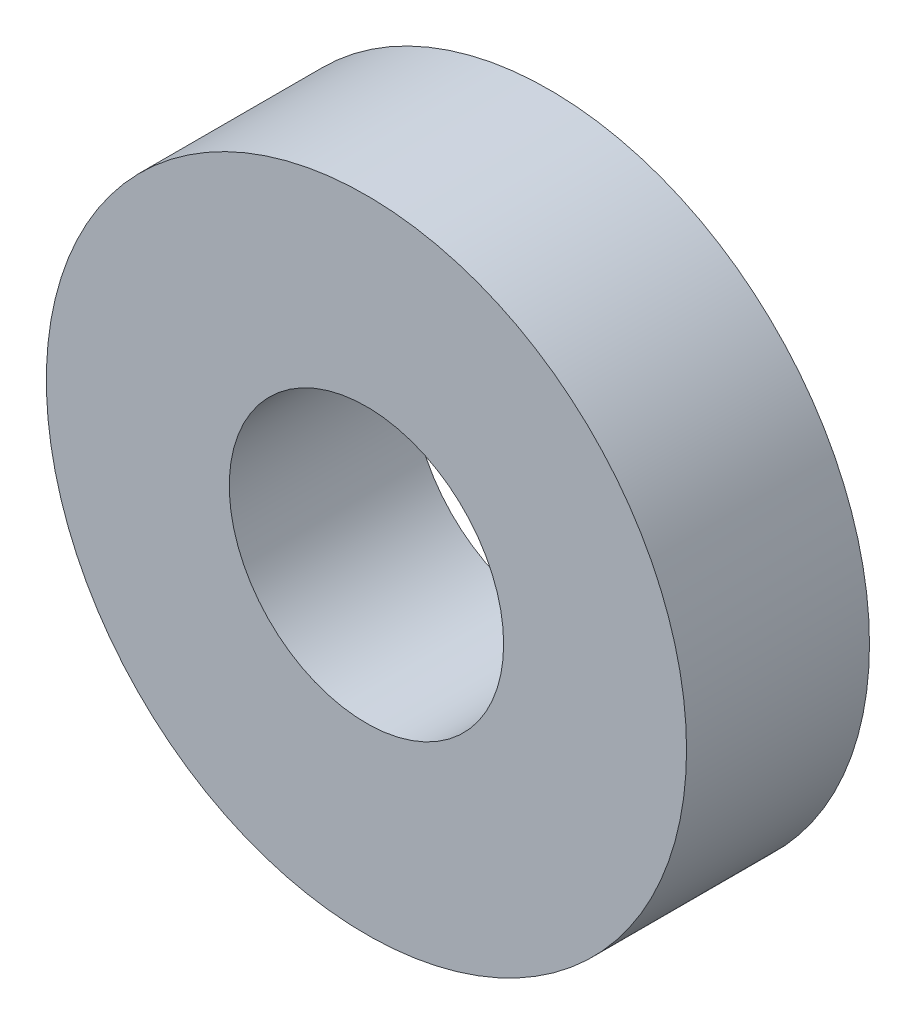
ISO-10303-21;
HEADER;
FILE_DESCRIPTION(('STEP AP214'),'2;1');
FILE_NAME('part.step','',(''),(''),'','','');
FILE_SCHEMA(('AUTOMOTIVE_DESIGN { 1 0 10303 214 1 1 1 1 }'));
ENDSEC;
DATA;
#1=APPLICATION_CONTEXT('core data for automotive mechanical design processes');
#2=APPLICATION_PROTOCOL_DEFINITION('international standard','automotive_design',2000,#1);
#3=PRODUCT_CONTEXT('',#1,'mechanical');
#4=PRODUCT('Part','Part','',(#3));
#5=PRODUCT_RELATED_PRODUCT_CATEGORY('part','',(#4));
#6=PRODUCT_DEFINITION_FORMATION('','',#4);
#7=PRODUCT_DEFINITION_CONTEXT('part definition',#1,'design');
#8=PRODUCT_DEFINITION('design','',#6,#7);
#9=PRODUCT_DEFINITION_SHAPE('','',#8);
#10=(LENGTH_UNIT() NAMED_UNIT(*) SI_UNIT(.MILLI.,.METRE.));
#11=(NAMED_UNIT(*) PLANE_ANGLE_UNIT() SI_UNIT($,.RADIAN.));
#12=(NAMED_UNIT(*) SI_UNIT($,.STERADIAN.) SOLID_ANGLE_UNIT());
#13=UNCERTAINTY_MEASURE_WITH_UNIT(LENGTH_MEASURE(1.E-05),#10,'distance_accuracy_value','');
#14=(GEOMETRIC_REPRESENTATION_CONTEXT(3) GLOBAL_UNCERTAINTY_ASSIGNED_CONTEXT((#13)) GLOBAL_UNIT_ASSIGNED_CONTEXT((#10,
#11,#12)) REPRESENTATION_CONTEXT('',''));
#15=CARTESIAN_POINT('',(0.,0.,0.));
#16=DIRECTION('',(0.,0.,1.));
#17=DIRECTION('',(1.,0.,0.));
#18=AXIS2_PLACEMENT_3D('',#15,#16,#17);
#19=CARTESIAN_POINT('',(0.,0.,1.));
#20=DIRECTION('',(0.,0.,1.));
#21=DIRECTION('',(1.,0.,0.));
#22=AXIS2_PLACEMENT_3D('',#19,#20,#21);
#23=PLANE('',#22);
#24=CARTESIAN_POINT('',(0.,0.,1.));
#25=DIRECTION('',(0.,0.,1.));
#26=DIRECTION('',(1.,0.,0.));
#27=AXIS2_PLACEMENT_3D('',#24,#25,#26);
#28=CIRCLE('',#27,1.75);
#29=CARTESIAN_POINT('',(1.75,0.,1.));
#30=VERTEX_POINT('',#29);
#31=EDGE_CURVE('E10',#30,#30,#28,.T.);
#32=ORIENTED_EDGE('',*,*,#31,.T.);
#33=EDGE_LOOP('',(#32));
#34=FACE_BOUND('',#33,.T.);
#35=CARTESIAN_POINT('',(0.,0.,1.));
#36=DIRECTION('',(0.,0.,1.));
#37=DIRECTION('',(1.,0.,0.));
#38=AXIS2_PLACEMENT_3D('',#35,#36,#37);
#39=CIRCLE('',#38,0.75);
#40=CARTESIAN_POINT('',(0.75,0.,1.));
#41=VERTEX_POINT('',#40);
#42=EDGE_CURVE('E41',#41,#41,#39,.T.);
#43=ORIENTED_EDGE('',*,*,#42,.F.);
#44=EDGE_LOOP('',(#43));
#45=FACE_BOUND('',#44,.T.);
#46=ADVANCED_FACE('F30',(#34,#45),#23,.T.);
#47=CARTESIAN_POINT('',(0.,0.,0.));
#48=DIRECTION('',(0.,0.,1.));
#49=DIRECTION('',(1.,0.,0.));
#50=AXIS2_PLACEMENT_3D('',#47,#48,#49);
#51=PLANE('',#50);
#52=CARTESIAN_POINT('',(0.,0.,0.));
#53=DIRECTION('',(0.,0.,1.));
#54=DIRECTION('',(1.,0.,0.));
#55=AXIS2_PLACEMENT_3D('',#52,#53,#54);
#56=CIRCLE('',#55,1.75);
#57=CARTESIAN_POINT('',(1.75,0.,0.));
#58=VERTEX_POINT('',#57);
#59=EDGE_CURVE('E34',#58,#58,#56,.T.);
#60=ORIENTED_EDGE('',*,*,#59,.F.);
#61=EDGE_LOOP('',(#60));
#62=FACE_BOUND('',#61,.T.);
#63=CARTESIAN_POINT('',(0.,0.,0.));
#64=DIRECTION('',(0.,0.,1.));
#65=DIRECTION('',(1.,0.,0.));
#66=AXIS2_PLACEMENT_3D('',#63,#64,#65);
#67=CIRCLE('',#66,0.75);
#68=CARTESIAN_POINT('',(0.75,0.,0.));
#69=VERTEX_POINT('',#68);
#70=EDGE_CURVE('E43',#69,#69,#67,.T.);
#71=ORIENTED_EDGE('',*,*,#70,.T.);
#72=EDGE_LOOP('',(#71));
#73=FACE_BOUND('',#72,.T.);
#74=ADVANCED_FACE('F53',(#62,#73),#51,.F.);
#75=CARTESIAN_POINT('',(0.,0.,1.));
#76=DIRECTION('',(0.,0.,-1.));
#77=DIRECTION('',(-1.,0.,0.));
#78=AXIS2_PLACEMENT_3D('',#75,#76,#77);
#79=CYLINDRICAL_SURFACE('',#78,1.75);
#80=ORIENTED_EDGE('',*,*,#31,.F.);
#81=EDGE_LOOP('',(#80));
#82=FACE_BOUND('',#81,.T.);
#83=ORIENTED_EDGE('',*,*,#59,.T.);
#84=EDGE_LOOP('',(#83));
#85=FACE_BOUND('',#84,.T.);
#86=ADVANCED_FACE('F32',(#82,#85),#79,.T.);
#87=CARTESIAN_POINT('',(0.,0.,1.));
#88=DIRECTION('',(0.,0.,-1.));
#89=DIRECTION('',(-1.,0.,0.));
#90=AXIS2_PLACEMENT_3D('',#87,#88,#89);
#91=CYLINDRICAL_SURFACE('',#90,0.75);
#92=ORIENTED_EDGE('',*,*,#42,.T.);
#93=EDGE_LOOP('',(#92));
#94=FACE_BOUND('',#93,.T.);
#95=ORIENTED_EDGE('',*,*,#70,.F.);
#96=EDGE_LOOP('',(#95));
#97=FACE_BOUND('',#96,.T.);
#98=ADVANCED_FACE('F49',(#94,#97),#91,.F.);
#99=CLOSED_SHELL('',(#46,#74,#86,#98));
#100=MANIFOLD_SOLID_BREP('B2',#99);
#101=ADVANCED_BREP_SHAPE_REPRESENTATION('',(#18,#100),#14);
#102=SHAPE_DEFINITION_REPRESENTATION(#9,#101);
ENDSEC;
END-ISO-10303-21;
